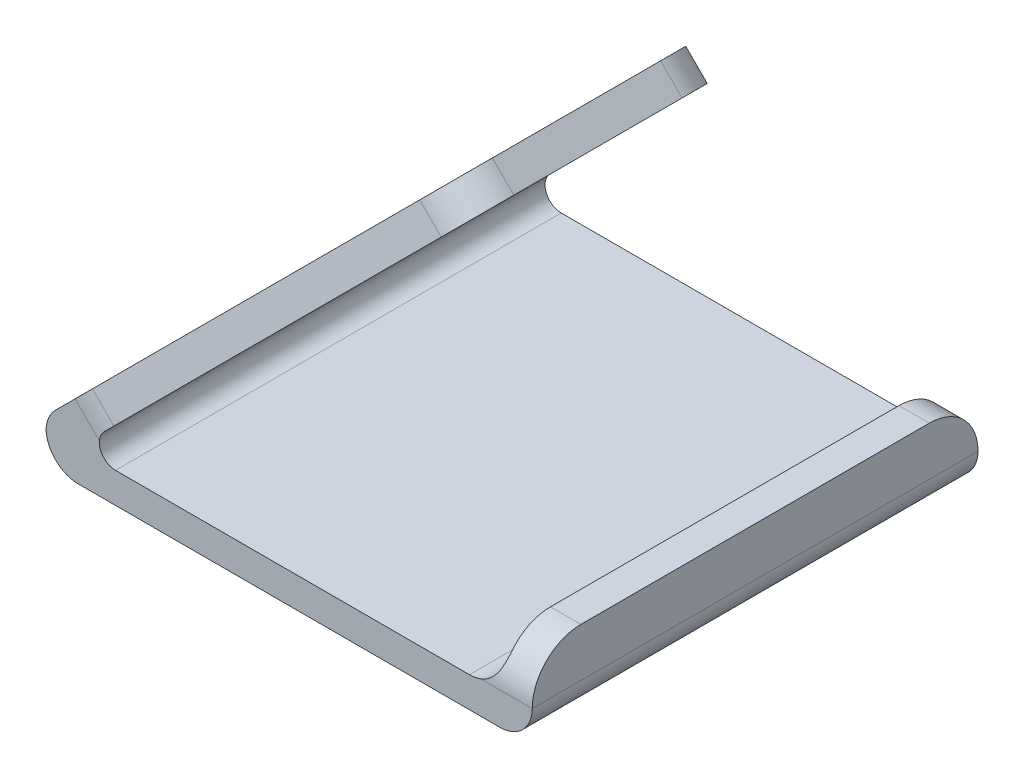
ISO-10303-21;
HEADER;
FILE_DESCRIPTION(('STEP AP214'),'2;1');
FILE_NAME('part.step','',(''),(''),'','','');
FILE_SCHEMA(('AUTOMOTIVE_DESIGN { 1 0 10303 214 1 1 1 1 }'));
ENDSEC;
DATA;
#1=APPLICATION_CONTEXT('core data for automotive mechanical design processes');
#2=APPLICATION_PROTOCOL_DEFINITION('international standard','automotive_design',2000,#1);
#3=PRODUCT_CONTEXT('',#1,'mechanical');
#4=PRODUCT('Part','Part','',(#3));
#5=PRODUCT_RELATED_PRODUCT_CATEGORY('part','',(#4));
#6=PRODUCT_DEFINITION_FORMATION('','',#4);
#7=PRODUCT_DEFINITION_CONTEXT('part definition',#1,'design');
#8=PRODUCT_DEFINITION('design','',#6,#7);
#9=PRODUCT_DEFINITION_SHAPE('','',#8);
#10=(LENGTH_UNIT() NAMED_UNIT(*) SI_UNIT(.MILLI.,.METRE.));
#11=(NAMED_UNIT(*) PLANE_ANGLE_UNIT() SI_UNIT($,.RADIAN.));
#12=(NAMED_UNIT(*) SI_UNIT($,.STERADIAN.) SOLID_ANGLE_UNIT());
#13=UNCERTAINTY_MEASURE_WITH_UNIT(LENGTH_MEASURE(1.E-05),#10,'distance_accuracy_value','');
#14=(GEOMETRIC_REPRESENTATION_CONTEXT(3) GLOBAL_UNCERTAINTY_ASSIGNED_CONTEXT((#13)) GLOBAL_UNIT_ASSIGNED_CONTEXT((#10,
#11,#12)) REPRESENTATION_CONTEXT('',''));
#15=CARTESIAN_POINT('',(0.,0.,0.));
#16=DIRECTION('',(0.,0.,1.));
#17=DIRECTION('',(1.,0.,0.));
#18=AXIS2_PLACEMENT_3D('',#15,#16,#17);
#19=CARTESIAN_POINT('',(0.,12.7,69.85));
#20=DIRECTION('',(-1.,0.,0.));
#21=DIRECTION('',(0.,-1.,0.));
#22=AXIS2_PLACEMENT_3D('',#19,#20,#21);
#23=PLANE('',#22);
#24=DIRECTION('',(0.,0.,-1.));
#25=VECTOR('',#24,1.);
#26=CARTESIAN_POINT('',(0.,5.08,69.85));
#27=LINE('',#26,#25);
#28=CARTESIAN_POINT('',(0.,5.08,69.85));
#29=VERTEX_POINT('',#28);
#30=CARTESIAN_POINT('',(0.,5.08,0.));
#31=VERTEX_POINT('',#30);
#32=EDGE_CURVE('E257',#29,#31,#27,.T.);
#33=ORIENTED_EDGE('',*,*,#32,.T.);
#34=CARTESIAN_POINT('',(0.,5.08,7.62));
#35=DIRECTION('',(-1.,0.,0.));
#36=DIRECTION('',(0.,-1.,0.));
#37=AXIS2_PLACEMENT_3D('',#34,#35,#36);
#38=CIRCLE('',#37,7.62);
#39=CARTESIAN_POINT('',(0.,12.7,7.62));
#40=VERTEX_POINT('',#39);
#41=EDGE_CURVE('E454',#31,#40,#38,.F.);
#42=ORIENTED_EDGE('',*,*,#41,.T.);
#43=DIRECTION('',(0.,0.,-1.));
#44=VECTOR('',#43,1.);
#45=CARTESIAN_POINT('',(0.,12.7,69.85));
#46=LINE('',#45,#44);
#47=CARTESIAN_POINT('',(0.,12.7,62.23));
#48=VERTEX_POINT('',#47);
#49=EDGE_CURVE('E234',#48,#40,#46,.T.);
#50=ORIENTED_EDGE('',*,*,#49,.F.);
#51=CARTESIAN_POINT('',(0.,5.08,62.23));
#52=DIRECTION('',(-1.,0.,0.));
#53=DIRECTION('',(0.,-1.,0.));
#54=AXIS2_PLACEMENT_3D('',#51,#52,#53);
#55=CIRCLE('',#54,7.62);
#56=EDGE_CURVE('E457',#48,#29,#55,.F.);
#57=ORIENTED_EDGE('',*,*,#56,.T.);
#58=EDGE_LOOP('',(#33,#42,#50,#57));
#59=FACE_BOUND('',#58,.T.);
#60=ADVANCED_FACE('F39',(#59),#23,.F.);
#61=CARTESIAN_POINT('',(-4.7625,12.7,69.85));
#62=DIRECTION('',(0.,-1.,0.));
#63=DIRECTION('',(0.,0.,-1.));
#64=AXIS2_PLACEMENT_3D('',#61,#62,#63);
#65=PLANE('',#64);
#66=ORIENTED_EDGE('',*,*,#49,.T.);
#67=DIRECTION('',(-1.,0.,0.));
#68=VECTOR('',#67,1.);
#69=CARTESIAN_POINT('',(-4.7625,12.7,7.62));
#70=LINE('',#69,#68);
#71=CARTESIAN_POINT('',(-4.7625,12.7,7.62));
#72=VERTEX_POINT('',#71);
#73=EDGE_CURVE('E295',#40,#72,#70,.T.);
#74=ORIENTED_EDGE('',*,*,#73,.T.);
#75=DIRECTION('',(0.,0.,-1.));
#76=VECTOR('',#75,1.);
#77=CARTESIAN_POINT('',(-4.7625,12.7,69.85));
#78=LINE('',#77,#76);
#79=CARTESIAN_POINT('',(-4.7625,12.7,62.23));
#80=VERTEX_POINT('',#79);
#81=EDGE_CURVE('E230',#80,#72,#78,.T.);
#82=ORIENTED_EDGE('',*,*,#81,.F.);
#83=DIRECTION('',(-1.,0.,0.));
#84=VECTOR('',#83,1.);
#85=CARTESIAN_POINT('',(-4.7625,12.7,62.23));
#86=LINE('',#85,#84);
#87=EDGE_CURVE('E292',#80,#48,#86,.F.);
#88=ORIENTED_EDGE('',*,*,#87,.T.);
#89=EDGE_LOOP('',(#66,#74,#82,#88));
#90=FACE_BOUND('',#89,.T.);
#91=ADVANCED_FACE('F373',(#90),#65,.F.);
#92=CARTESIAN_POINT('',(-4.7625,4.7625,69.85));
#93=DIRECTION('',(1.,0.,0.));
#94=DIRECTION('',(0.,1.,0.));
#95=AXIS2_PLACEMENT_3D('',#92,#93,#94);
#96=PLANE('',#95);
#97=ORIENTED_EDGE('',*,*,#81,.T.);
#98=CARTESIAN_POINT('',(-4.7625,5.08,7.62));
#99=DIRECTION('',(1.,0.,0.));
#100=DIRECTION('',(0.,1.,0.));
#101=AXIS2_PLACEMENT_3D('',#98,#99,#100);
#102=CIRCLE('',#101,7.62);
#103=CARTESIAN_POINT('',(-4.7625,9.8425,1.67163940652553));
#104=VERTEX_POINT('',#103);
#105=EDGE_CURVE('E302',#72,#104,#102,.F.);
#106=ORIENTED_EDGE('',*,*,#105,.T.);
#107=DIRECTION('',(0.,0.,-1.));
#108=VECTOR('',#107,1.);
#109=CARTESIAN_POINT('',(-4.7625,9.8425,69.85));
#110=LINE('',#109,#108);
#111=CARTESIAN_POINT('',(-4.7625,9.8425,68.1783605934745));
#112=VERTEX_POINT('',#111);
#113=EDGE_CURVE('E265',#104,#112,#110,.F.);
#114=ORIENTED_EDGE('',*,*,#113,.T.);
#115=CARTESIAN_POINT('',(-4.7625,5.08,62.23));
#116=DIRECTION('',(1.,0.,0.));
#117=DIRECTION('',(0.,1.,0.));
#118=AXIS2_PLACEMENT_3D('',#115,#116,#117);
#119=CIRCLE('',#118,7.62);
#120=EDGE_CURVE('E299',#112,#80,#119,.F.);
#121=ORIENTED_EDGE('',*,*,#120,.T.);
#122=EDGE_LOOP('',(#97,#106,#114,#121));
#123=FACE_BOUND('',#122,.T.);
#124=ADVANCED_FACE('F379',(#123),#96,.F.);
#125=CARTESIAN_POINT('',(-4.7625,4.7625,69.85));
#126=DIRECTION('',(0.,-1.,0.));
#127=DIRECTION('',(1.,0.,0.));
#128=AXIS2_PLACEMENT_3D('',#125,#126,#127);
#129=PLANE('',#128);
#130=DIRECTION('',(-1.,0.,0.));
#131=VECTOR('',#130,1.);
#132=CARTESIAN_POINT('',(-4.7625,4.7625,0.));
#133=LINE('',#132,#131);
#134=CARTESIAN_POINT('',(-9.8425,4.7625,0.));
#135=VERTEX_POINT('',#134);
#136=CARTESIAN_POINT('',(-65.3053975515724,4.76249999999999,0.));
#137=VERTEX_POINT('',#136);
#138=EDGE_CURVE('E218',#135,#137,#133,.T.);
#139=ORIENTED_EDGE('',*,*,#138,.T.);
#140=DIRECTION('',(0.,0.,-1.));
#141=VECTOR('',#140,1.);
#142=CARTESIAN_POINT('',(-65.3053975515724,4.76249999999999,69.85));
#143=LINE('',#142,#141);
#144=CARTESIAN_POINT('',(-65.3053975515724,4.76249999999999,69.85));
#145=VERTEX_POINT('',#144);
#146=EDGE_CURVE('E282',#137,#145,#143,.F.);
#147=ORIENTED_EDGE('',*,*,#146,.T.);
#148=DIRECTION('',(-1.,0.,0.));
#149=VECTOR('',#148,1.);
#150=CARTESIAN_POINT('',(-4.7625,4.7625,69.85));
#151=LINE('',#150,#149);
#152=CARTESIAN_POINT('',(-9.8425,4.7625,69.85));
#153=VERTEX_POINT('',#152);
#154=EDGE_CURVE('E210',#153,#145,#151,.T.);
#155=ORIENTED_EDGE('',*,*,#154,.F.);
#156=DIRECTION('',(0.,0.,-1.));
#157=VECTOR('',#156,1.);
#158=CARTESIAN_POINT('',(-9.8425,4.7625,0.));
#159=LINE('',#158,#157);
#160=EDGE_CURVE('E261',#153,#135,#159,.T.);
#161=ORIENTED_EDGE('',*,*,#160,.T.);
#162=EDGE_LOOP('',(#139,#147,#155,#161));
#163=FACE_BOUND('',#162,.T.);
#164=ADVANCED_FACE('F541',(#163),#129,.F.);
#165=CARTESIAN_POINT('',(-24.6307756962203,51.5692243037799,69.85));
#166=DIRECTION('',(-0.707106781186549,0.707106781186546,0.));
#167=DIRECTION('',(-0.707106781186546,-0.707106781186549,0.));
#168=AXIS2_PLACEMENT_3D('',#165,#166,#167);
#169=PLANE('',#168);
#170=DIRECTION('',(0.,0.,-1.));
#171=VECTOR('',#170,1.);
#172=CARTESIAN_POINT('',(-67.1014487757862,9.09855122421382,0.));
#173=LINE('',#172,#171);
#174=CARTESIAN_POINT('',(-67.1014487757862,9.09855122421382,69.7423558530693));
#175=VERTEX_POINT('',#174);
#176=CARTESIAN_POINT('',(-67.1014487757862,9.09855122421382,0.107644146930737));
#177=VERTEX_POINT('',#176);
#178=EDGE_CURVE('E276',#175,#177,#173,.T.);
#179=ORIENTED_EDGE('',*,*,#178,.T.);
#180=CARTESIAN_POINT('',(-68.2681908358989,7.93180916410106,12.7));
#181=DIRECTION('',(-0.707106781186549,0.707106781186546,0.));
#182=DIRECTION('',(-0.707106781186546,-0.707106781186549,0.));
#183=AXIS2_PLACEMENT_3D('',#180,#181,#182);
#184=CIRCLE('',#183,12.7);
#185=CARTESIAN_POINT('',(-65.9734420589467,10.2265579410533,0.421634632356286));
#186=VERTEX_POINT('',#185);
#187=EDGE_CURVE('E661',#177,#186,#184,.F.);
#188=ORIENTED_EDGE('',*,*,#187,.T.);
#189=DIRECTION('',(-0.683631134909205,-0.683631134909208,-0.25553266477204));
#190=VECTOR('',#189,1.);
#191=CARTESIAN_POINT('',(-24.6307756962203,51.5692243037799,15.875));
#192=LINE('',#191,#190);
#193=CARTESIAN_POINT('',(-28.6420801026904,47.5579198973098,14.3756251882702));
#194=VERTEX_POINT('',#193);
#195=EDGE_CURVE('E279',#194,#186,#192,.T.);
#196=ORIENTED_EDGE('',*,*,#195,.F.);
#197=CARTESIAN_POINT('',(-30.0189293688618,46.1810706311384,21.7426444088564));
#198=DIRECTION('',(-0.707106781186549,0.707106781186546,0.));
#199=DIRECTION('',(-0.707106781186546,-0.707106781186549,0.));
#200=AXIS2_PLACEMENT_3D('',#197,#198,#199);
#201=CIRCLE('',#200,7.62);
#202=CARTESIAN_POINT('',(-24.6307756962203,51.5692243037799,21.7426444088564));
#203=VERTEX_POINT('',#202);
#204=EDGE_CURVE('E429',#194,#203,#201,.F.);
#205=ORIENTED_EDGE('',*,*,#204,.T.);
#206=DIRECTION('',(0.,0.,-1.));
#207=VECTOR('',#206,1.);
#208=CARTESIAN_POINT('',(-24.6307756962203,51.5692243037799,69.85));
#209=LINE('',#208,#207);
#210=CARTESIAN_POINT('',(-24.6307756962203,51.5692243037799,48.1073555911436));
#211=VERTEX_POINT('',#210);
#212=EDGE_CURVE('E226',#211,#203,#209,.T.);
#213=ORIENTED_EDGE('',*,*,#212,.F.);
#214=CARTESIAN_POINT('',(-30.0189293688618,46.1810706311384,48.1073555911436));
#215=DIRECTION('',(-0.707106781186549,0.707106781186546,0.));
#216=DIRECTION('',(-0.707106781186546,-0.707106781186549,0.));
#217=AXIS2_PLACEMENT_3D('',#214,#215,#216);
#218=CIRCLE('',#217,7.62);
#219=CARTESIAN_POINT('',(-28.6420801026904,47.5579198973098,55.4743748117298));
#220=VERTEX_POINT('',#219);
#221=EDGE_CURVE('E425',#211,#220,#218,.F.);
#222=ORIENTED_EDGE('',*,*,#221,.T.);
#223=DIRECTION('',(0.683631134909205,0.683631134909208,-0.255532664772041));
#224=VECTOR('',#223,1.);
#225=CARTESIAN_POINT('',(-24.6307756962203,51.5692243037799,53.975));
#226=LINE('',#225,#224);
#227=CARTESIAN_POINT('',(-65.9734420589465,10.2265579410535,69.4283653676437));
#228=VERTEX_POINT('',#227);
#229=EDGE_CURVE('E636',#228,#220,#226,.T.);
#230=ORIENTED_EDGE('',*,*,#229,.F.);
#231=CARTESIAN_POINT('',(-68.2681908358988,7.93180916410124,57.15));
#232=DIRECTION('',(-0.707106781186549,0.707106781186546,0.));
#233=DIRECTION('',(-0.707106781186546,-0.707106781186549,0.));
#234=AXIS2_PLACEMENT_3D('',#231,#232,#233);
#235=CIRCLE('',#234,12.7);
#236=EDGE_CURVE('E354',#228,#175,#235,.F.);
#237=ORIENTED_EDGE('',*,*,#236,.T.);
#238=EDGE_LOOP('',(#179,#188,#196,#205,#213,#222,#230,#237));
#239=FACE_BOUND('',#238,.T.);
#240=ADVANCED_FACE('F535',(#239),#169,.F.);
#241=CARTESIAN_POINT('',(-27.9983717416212,54.9368203491808,69.85));
#242=DIRECTION('',(-0.707106781186545,-0.70710678118655,0.));
#243=DIRECTION('',(0.70710678118655,-0.707106781186545,0.));
#244=AXIS2_PLACEMENT_3D('',#241,#242,#243);
#245=PLANE('',#244);
#246=DIRECTION('',(0.,0.,-1.));
#247=VECTOR('',#246,1.);
#248=CARTESIAN_POINT('',(-27.9983717416212,54.9368203491808,69.85));
#249=LINE('',#248,#247);
#250=CARTESIAN_POINT('',(-27.9983717416212,54.9368203491808,48.1073555911436));
#251=VERTEX_POINT('',#250);
#252=CARTESIAN_POINT('',(-27.9983717416212,54.9368203491808,21.7426444088564));
#253=VERTEX_POINT('',#252);
#254=EDGE_CURVE('E222',#251,#253,#249,.T.);
#255=ORIENTED_EDGE('',*,*,#254,.F.);
#256=DIRECTION('',(-0.70710678118655,0.707106781186545,0.));
#257=VECTOR('',#256,1.);
#258=CARTESIAN_POINT('',(-27.9983717416212,54.9368203491808,48.1073555911436));
#259=LINE('',#258,#257);
#260=EDGE_CURVE('E432',#251,#211,#259,.F.);
#261=ORIENTED_EDGE('',*,*,#260,.T.);
#262=ORIENTED_EDGE('',*,*,#212,.T.);
#263=DIRECTION('',(-0.70710678118655,0.707106781186545,0.));
#264=VECTOR('',#263,1.);
#265=CARTESIAN_POINT('',(-27.9983717416212,54.9368203491808,21.7426444088564));
#266=LINE('',#265,#264);
#267=EDGE_CURVE('E435',#203,#253,#266,.T.);
#268=ORIENTED_EDGE('',*,*,#267,.T.);
#269=EDGE_LOOP('',(#255,#261,#262,#268));
#270=FACE_BOUND('',#269,.T.);
#271=ADVANCED_FACE('F540',(#270),#245,.F.);
#272=CARTESIAN_POINT('',(-76.2,6.73519209080186,69.85));
#273=DIRECTION('',(0.707106781186549,-0.707106781186546,0.));
#274=DIRECTION('',(0.707106781186546,0.707106781186549,0.));
#275=AXIS2_PLACEMENT_3D('',#272,#273,#274);
#276=PLANE('',#275);
#277=DIRECTION('',(0.683631134909205,0.683631134909208,0.25553266477204));
#278=VECTOR('',#277,1.);
#279=CARTESIAN_POINT('',(-27.9983717416212,54.9368203491808,15.875));
#280=LINE('',#279,#278);
#281=CARTESIAN_POINT('',(-69.3410381043477,13.5941539864542,0.421634632356286));
#282=VERTEX_POINT('',#281);
#283=CARTESIAN_POINT('',(-32.0096761480914,50.9255159427107,14.3756251882702));
#284=VERTEX_POINT('',#283);
#285=EDGE_CURVE('E641',#282,#284,#280,.T.);
#286=ORIENTED_EDGE('',*,*,#285,.F.);
#287=CARTESIAN_POINT('',(-71.6357868812999,11.299405209502,12.7));
#288=DIRECTION('',(0.707106781186549,-0.707106781186546,0.));
#289=DIRECTION('',(0.707106781186546,0.707106781186549,0.));
#290=AXIS2_PLACEMENT_3D('',#287,#288,#289);
#291=CIRCLE('',#290,12.7);
#292=CARTESIAN_POINT('',(-71.6357868812999,11.299405209502,0.));
#293=VERTEX_POINT('',#292);
#294=EDGE_CURVE('E405',#282,#293,#291,.F.);
#295=ORIENTED_EDGE('',*,*,#294,.T.);
#296=DIRECTION('',(-0.707106781186546,-0.707106781186549,0.));
#297=VECTOR('',#296,1.);
#298=CARTESIAN_POINT('',(-76.2,6.73519209080186,0.));
#299=LINE('',#298,#297);
#300=CARTESIAN_POINT('',(-74.7121024484277,8.2230896423742,0.));
#301=VERTEX_POINT('',#300);
#302=EDGE_CURVE('E211',#293,#301,#299,.T.);
#303=ORIENTED_EDGE('',*,*,#302,.T.);
#304=DIRECTION('',(0.,0.,-1.));
#305=VECTOR('',#304,1.);
#306=CARTESIAN_POINT('',(-74.7121024484277,8.2230896423742,69.85));
#307=LINE('',#306,#305);
#308=CARTESIAN_POINT('',(-74.7121024484277,8.2230896423742,69.85));
#309=VERTEX_POINT('',#308);
#310=EDGE_CURVE('E253',#301,#309,#307,.F.);
#311=ORIENTED_EDGE('',*,*,#310,.T.);
#312=DIRECTION('',(-0.707106781186546,-0.707106781186549,0.));
#313=VECTOR('',#312,1.);
#314=CARTESIAN_POINT('',(-76.2,6.73519209080186,69.85));
#315=LINE('',#314,#313);
#316=CARTESIAN_POINT('',(-71.6357868812997,11.2994052095022,69.85));
#317=VERTEX_POINT('',#316);
#318=EDGE_CURVE('E216',#317,#309,#315,.T.);
#319=ORIENTED_EDGE('',*,*,#318,.F.);
#320=CARTESIAN_POINT('',(-71.6357868812997,11.2994052095022,57.15));
#321=DIRECTION('',(0.707106781186549,-0.707106781186546,0.));
#322=DIRECTION('',(0.707106781186546,0.707106781186549,0.));
#323=AXIS2_PLACEMENT_3D('',#320,#321,#322);
#324=CIRCLE('',#323,12.7);
#325=CARTESIAN_POINT('',(-69.3410381043475,13.5941539864544,69.4283653676437));
#326=VERTEX_POINT('',#325);
#327=EDGE_CURVE('E414',#317,#326,#324,.F.);
#328=ORIENTED_EDGE('',*,*,#327,.T.);
#329=DIRECTION('',(-0.683631134909205,-0.683631134909208,0.255532664772041));
#330=VECTOR('',#329,1.);
#331=CARTESIAN_POINT('',(-27.9983717416212,54.9368203491808,53.975));
#332=LINE('',#331,#330);
#333=CARTESIAN_POINT('',(-32.0096761480914,50.9255159427107,55.4743748117298));
#334=VERTEX_POINT('',#333);
#335=EDGE_CURVE('E643',#334,#326,#332,.T.);
#336=ORIENTED_EDGE('',*,*,#335,.F.);
#337=CARTESIAN_POINT('',(-33.3865254142627,49.5486666765393,48.1073555911436));
#338=DIRECTION('',(0.707106781186549,-0.707106781186546,0.));
#339=DIRECTION('',(0.707106781186546,0.707106781186549,0.));
#340=AXIS2_PLACEMENT_3D('',#337,#338,#339);
#341=CIRCLE('',#340,7.62);
#342=EDGE_CURVE('E439',#334,#251,#341,.F.);
#343=ORIENTED_EDGE('',*,*,#342,.T.);
#344=ORIENTED_EDGE('',*,*,#254,.T.);
#345=CARTESIAN_POINT('',(-33.3865254142627,49.5486666765393,21.7426444088564));
#346=DIRECTION('',(0.707106781186549,-0.707106781186546,0.));
#347=DIRECTION('',(0.707106781186546,0.707106781186549,0.));
#348=AXIS2_PLACEMENT_3D('',#345,#346,#347);
#349=CIRCLE('',#348,7.62);
#350=EDGE_CURVE('E442',#253,#284,#349,.F.);
#351=ORIENTED_EDGE('',*,*,#350,.T.);
#352=EDGE_LOOP('',(#286,#295,#303,#311,#319,#328,#336,#343,#344,#351));
#353=FACE_BOUND('',#352,.T.);
#354=ADVANCED_FACE('F404',(#353),#276,.F.);
#355=CARTESIAN_POINT('',(0.,0.,69.85));
#356=DIRECTION('',(0.,1.,0.));
#357=DIRECTION('',(-1.,0.,0.));
#358=AXIS2_PLACEMENT_3D('',#355,#356,#357);
#359=PLANE('',#358);
#360=DIRECTION('',(1.,0.,0.));
#361=VECTOR('',#360,1.);
#362=CARTESIAN_POINT('',(0.,0.,69.85));
#363=LINE('',#362,#361);
#364=CARTESIAN_POINT('',(-71.12,0.,69.85));
#365=VERTEX_POINT('',#364);
#366=CARTESIAN_POINT('',(-5.08,0.,69.85));
#367=VERTEX_POINT('',#366);
#368=EDGE_CURVE('E201',#365,#367,#363,.T.);
#369=ORIENTED_EDGE('',*,*,#368,.F.);
#370=DIRECTION('',(0.,0.,-1.));
#371=VECTOR('',#370,1.);
#372=CARTESIAN_POINT('',(-71.12,0.,69.85));
#373=LINE('',#372,#371);
#374=CARTESIAN_POINT('',(-71.12,0.,0.));
#375=VERTEX_POINT('',#374);
#376=EDGE_CURVE('E183',#365,#375,#373,.T.);
#377=ORIENTED_EDGE('',*,*,#376,.T.);
#378=DIRECTION('',(1.,0.,0.));
#379=VECTOR('',#378,1.);
#380=CARTESIAN_POINT('',(0.,0.,0.));
#381=LINE('',#380,#379);
#382=CARTESIAN_POINT('',(-5.08,0.,0.));
#383=VERTEX_POINT('',#382);
#384=EDGE_CURVE('E198',#375,#383,#381,.T.);
#385=ORIENTED_EDGE('',*,*,#384,.T.);
#386=DIRECTION('',(0.,0.,-1.));
#387=VECTOR('',#386,1.);
#388=CARTESIAN_POINT('',(-5.08,0.,69.85));
#389=LINE('',#388,#387);
#390=EDGE_CURVE('E204',#383,#367,#389,.F.);
#391=ORIENTED_EDGE('',*,*,#390,.T.);
#392=EDGE_LOOP('',(#369,#377,#385,#391));
#393=FACE_BOUND('',#392,.T.);
#394=ADVANCED_FACE('F197',(#393),#359,.F.);
#395=CARTESIAN_POINT('',(0.,0.,69.85));
#396=DIRECTION('',(0.,0.,-1.));
#397=DIRECTION('',(-1.,0.,0.));
#398=AXIS2_PLACEMENT_3D('',#395,#396,#397);
#399=PLANE('',#398);
#400=CARTESIAN_POINT('',(-65.3053975515724,7.3025,69.85));
#401=DIRECTION('',(0.,0.,-1.));
#402=DIRECTION('',(-1.,0.,0.));
#403=AXIS2_PLACEMENT_3D('',#400,#401,#402);
#404=CIRCLE('',#403,2.54);
#405=CARTESIAN_POINT('',(-67.837611312294,7.50122964049649,69.85));
#406=VERTEX_POINT('',#405);
#407=EDGE_CURVE('E288',#145,#406,#404,.T.);
#408=ORIENTED_EDGE('',*,*,#407,.T.);
#409=DIRECTION('',(-0.707106781186549,0.707106781186546,0.));
#410=VECTOR('',#409,1.);
#411=CARTESIAN_POINT('',(-30.1681908358986,-30.1681908358987,69.85));
#412=LINE('',#411,#410);
#413=EDGE_CURVE('E49',#406,#317,#412,.T.);
#414=ORIENTED_EDGE('',*,*,#413,.T.);
#415=ORIENTED_EDGE('',*,*,#318,.T.);
#416=CARTESIAN_POINT('',(-71.12,4.63098719394654,69.85));
#417=DIRECTION('',(0.,0.,-1.));
#418=DIRECTION('',(-1.,0.,0.));
#419=AXIS2_PLACEMENT_3D('',#416,#417,#418);
#420=CIRCLE('',#419,5.08);
#421=CARTESIAN_POINT('',(-76.1950366377988,4.85549359697327,69.85));
#422=VERTEX_POINT('',#421);
#423=EDGE_CURVE('E247',#309,#422,#420,.F.);
#424=ORIENTED_EDGE('',*,*,#423,.T.);
#425=CARTESIAN_POINT('',(-71.12,5.07999999999999,69.85));
#426=DIRECTION('',(0.,0.,-1.));
#427=DIRECTION('',(-1.,0.,0.));
#428=AXIS2_PLACEMENT_3D('',#425,#426,#427);
#429=CIRCLE('',#428,5.08);
#430=EDGE_CURVE('E250',#422,#365,#429,.F.);
#431=ORIENTED_EDGE('',*,*,#430,.T.);
#432=ORIENTED_EDGE('',*,*,#368,.T.);
#433=CARTESIAN_POINT('',(-5.08,5.08,69.85));
#434=DIRECTION('',(0.,0.,-1.));
#435=DIRECTION('',(-1.,0.,0.));
#436=AXIS2_PLACEMENT_3D('',#433,#434,#435);
#437=CIRCLE('',#436,5.08);
#438=EDGE_CURVE('E191',#367,#29,#437,.F.);
#439=ORIENTED_EDGE('',*,*,#438,.T.);
#440=DIRECTION('',(-1.,0.,0.));
#441=VECTOR('',#440,1.);
#442=CARTESIAN_POINT('',(0.,5.08,69.85));
#443=LINE('',#442,#441);
#444=CARTESIAN_POINT('',(-8.07473481480147,5.08,69.85));
#445=VERTEX_POINT('',#444);
#446=EDGE_CURVE('E450',#29,#445,#443,.T.);
#447=ORIENTED_EDGE('',*,*,#446,.T.);
#448=CARTESIAN_POINT('',(-9.8425,9.8425,69.85));
#449=DIRECTION('',(0.,0.,-1.));
#450=DIRECTION('',(-1.,0.,0.));
#451=AXIS2_PLACEMENT_3D('',#448,#449,#450);
#452=CIRCLE('',#451,5.08);
#453=EDGE_CURVE('E273',#445,#153,#452,.T.);
#454=ORIENTED_EDGE('',*,*,#453,.T.);
#455=ORIENTED_EDGE('',*,*,#154,.T.);
#456=EDGE_LOOP('',(#408,#414,#415,#424,#431,#432,#439,#447,#454,#455));
#457=FACE_BOUND('',#456,.T.);
#458=ADVANCED_FACE('F391',(#457),#399,.F.);
#459=CARTESIAN_POINT('',(0.,0.,0.));
#460=DIRECTION('',(0.,0.,-1.));
#461=DIRECTION('',(-1.,0.,0.));
#462=AXIS2_PLACEMENT_3D('',#459,#460,#461);
#463=PLANE('',#462);
#464=ORIENTED_EDGE('',*,*,#302,.F.);
#465=DIRECTION('',(-0.707106781186549,0.707106781186546,0.));
#466=VECTOR('',#465,1.);
#467=CARTESIAN_POINT('',(-68.2681908358989,7.93180916410106,0.));
#468=LINE('',#467,#466);
#469=CARTESIAN_POINT('',(-67.837611312294,7.50122964049616,0.));
#470=VERTEX_POINT('',#469);
#471=EDGE_CURVE('E407',#293,#470,#468,.F.);
#472=ORIENTED_EDGE('',*,*,#471,.T.);
#473=CARTESIAN_POINT('',(-65.3053975515724,7.3025,0.));
#474=DIRECTION('',(0.,0.,-1.));
#475=DIRECTION('',(-1.,0.,0.));
#476=AXIS2_PLACEMENT_3D('',#473,#474,#475);
#477=CIRCLE('',#476,2.54);
#478=EDGE_CURVE('E285',#470,#137,#477,.F.);
#479=ORIENTED_EDGE('',*,*,#478,.T.);
#480=ORIENTED_EDGE('',*,*,#138,.F.);
#481=CARTESIAN_POINT('',(-9.8425,9.8425,0.));
#482=DIRECTION('',(0.,0.,-1.));
#483=DIRECTION('',(-1.,0.,0.));
#484=AXIS2_PLACEMENT_3D('',#481,#482,#483);
#485=CIRCLE('',#484,5.08);
#486=CARTESIAN_POINT('',(-8.07473481480147,5.08,0.));
#487=VERTEX_POINT('',#486);
#488=EDGE_CURVE('E269',#135,#487,#485,.F.);
#489=ORIENTED_EDGE('',*,*,#488,.T.);
#490=DIRECTION('',(-1.,0.,0.));
#491=VECTOR('',#490,1.);
#492=CARTESIAN_POINT('',(0.,5.08,0.));
#493=LINE('',#492,#491);
#494=EDGE_CURVE('E459',#487,#31,#493,.F.);
#495=ORIENTED_EDGE('',*,*,#494,.T.);
#496=CARTESIAN_POINT('',(-5.08,5.08,0.));
#497=DIRECTION('',(0.,0.,-1.));
#498=DIRECTION('',(-1.,0.,0.));
#499=AXIS2_PLACEMENT_3D('',#496,#497,#498);
#500=CIRCLE('',#499,5.08);
#501=EDGE_CURVE('E203',#31,#383,#500,.T.);
#502=ORIENTED_EDGE('',*,*,#501,.T.);
#503=ORIENTED_EDGE('',*,*,#384,.F.);
#504=CARTESIAN_POINT('',(-71.12,5.07999999999999,0.));
#505=DIRECTION('',(0.,0.,-1.));
#506=DIRECTION('',(-1.,0.,0.));
#507=AXIS2_PLACEMENT_3D('',#504,#505,#506);
#508=CIRCLE('',#507,5.08);
#509=CARTESIAN_POINT('',(-76.1950366377988,4.85549359697327,0.));
#510=VERTEX_POINT('',#509);
#511=EDGE_CURVE('E179',#375,#510,#508,.T.);
#512=ORIENTED_EDGE('',*,*,#511,.T.);
#513=CARTESIAN_POINT('',(-71.12,4.63098719394654,0.));
#514=DIRECTION('',(0.,0.,-1.));
#515=DIRECTION('',(-1.,0.,0.));
#516=AXIS2_PLACEMENT_3D('',#513,#514,#515);
#517=CIRCLE('',#516,5.08);
#518=EDGE_CURVE('E192',#510,#301,#517,.T.);
#519=ORIENTED_EDGE('',*,*,#518,.T.);
#520=EDGE_LOOP('',(#464,#472,#479,#480,#489,#495,#502,#503,#512,#519));
#521=FACE_BOUND('',#520,.T.);
#522=ADVANCED_FACE('F207',(#521),#463,.T.);
#523=CARTESIAN_POINT('',(-71.12,4.63098719394654,69.85));
#524=DIRECTION('',(0.,0.,-1.));
#525=DIRECTION('',(-1.,0.,0.));
#526=AXIS2_PLACEMENT_3D('',#523,#524,#525);
#527=CYLINDRICAL_SURFACE('',#526,5.08);
#528=DIRECTION('',(0.,0.,-1.));
#529=VECTOR('',#528,1.);
#530=CARTESIAN_POINT('',(-76.1950366377988,4.85549359697327,34.925));
#531=LINE('',#530,#529);
#532=EDGE_CURVE('E185',#422,#510,#531,.T.);
#533=ORIENTED_EDGE('',*,*,#532,.F.);
#534=ORIENTED_EDGE('',*,*,#423,.F.);
#535=ORIENTED_EDGE('',*,*,#310,.F.);
#536=ORIENTED_EDGE('',*,*,#518,.F.);
#537=EDGE_LOOP('',(#533,#534,#535,#536));
#538=FACE_BOUND('',#537,.T.);
#539=ADVANCED_FACE('F385',(#538),#527,.T.);
#540=CARTESIAN_POINT('',(-71.12,5.07999999999999,69.85));
#541=DIRECTION('',(0.,0.,-1.));
#542=DIRECTION('',(-1.,0.,0.));
#543=AXIS2_PLACEMENT_3D('',#540,#541,#542);
#544=CYLINDRICAL_SURFACE('',#543,5.08);
#545=ORIENTED_EDGE('',*,*,#430,.F.);
#546=ORIENTED_EDGE('',*,*,#532,.T.);
#547=ORIENTED_EDGE('',*,*,#511,.F.);
#548=ORIENTED_EDGE('',*,*,#376,.F.);
#549=EDGE_LOOP('',(#545,#546,#547,#548));
#550=FACE_BOUND('',#549,.T.);
#551=ADVANCED_FACE('F182',(#550),#544,.T.);
#552=CARTESIAN_POINT('',(-5.08,5.08,69.85));
#553=DIRECTION('',(0.,0.,-1.));
#554=DIRECTION('',(-1.,0.,0.));
#555=AXIS2_PLACEMENT_3D('',#552,#553,#554);
#556=CYLINDRICAL_SURFACE('',#555,5.08);
#557=ORIENTED_EDGE('',*,*,#438,.F.);
#558=ORIENTED_EDGE('',*,*,#390,.F.);
#559=ORIENTED_EDGE('',*,*,#501,.F.);
#560=ORIENTED_EDGE('',*,*,#32,.F.);
#561=EDGE_LOOP('',(#557,#558,#559,#560));
#562=FACE_BOUND('',#561,.T.);
#563=ADVANCED_FACE('F330',(#562),#556,.T.);
#564=CARTESIAN_POINT('',(-9.8425,9.8425,69.85));
#565=DIRECTION('',(0.,0.,1.));
#566=DIRECTION('',(1.,0.,0.));
#567=AXIS2_PLACEMENT_3D('',#564,#565,#566);
#568=CYLINDRICAL_SURFACE('',#567,5.08);
#569=ORIENTED_EDGE('',*,*,#113,.F.);
#570=CARTESIAN_POINT('',(-4.7625,9.8425,1.67163940652553));
#571=CARTESIAN_POINT('',(-4.76248934075149,9.73607523403745,1.58640254437952));
#572=CARTESIAN_POINT('',(-4.76584480010724,9.62729983064273,1.50402872084206));
#573=CARTESIAN_POINT('',(-4.78009462889294,9.40574104197163,1.34538027066019));
#574=CARTESIAN_POINT('',(-4.79099500759263,9.29295452995789,1.26911055979027));
#575=CARTESIAN_POINT('',(-4.82118796168516,9.06390496883602,1.12296763840993));
#576=CARTESIAN_POINT('',(-4.8405049594166,8.94763272649719,1.05311376425537));
#577=CARTESIAN_POINT('',(-4.88821722157851,8.71298292267485,0.920448700022118));
#578=CARTESIAN_POINT('',(-4.91660998165525,8.59460595046749,0.857635573579428));
#579=CARTESIAN_POINT('',(-4.98319339816391,8.35625295659713,0.738983767115417));
#580=CARTESIAN_POINT('',(-5.02143606553107,8.23627175430256,0.683184524482634));
#581=CARTESIAN_POINT('',(-5.10799575220775,7.99666846724369,0.579083289434685));
#582=CARTESIAN_POINT('',(-5.15631366718006,7.8770464153666,0.530781964230872));
#583=CARTESIAN_POINT('',(-5.26299272681702,7.63991782024807,0.441753850154116));
#584=CARTESIAN_POINT('',(-5.32132555811158,7.52240631759923,0.401006363354379));
#585=CARTESIAN_POINT('',(-5.44801341320852,7.29057270312571,0.326675205953075));
#586=CARTESIAN_POINT('',(-5.51636764554498,7.17625034027843,0.293090970129064));
#587=CARTESIAN_POINT('',(-5.65700222668459,6.96096967186279,0.235029363937482));
#588=CARTESIAN_POINT('',(-5.7285492348436,6.85966800494741,0.210043036171265));
#589=CARTESIAN_POINT('',(-5.87951967797226,6.66182777951721,0.165302709691961));
#590=CARTESIAN_POINT('',(-5.95894634005705,6.56529119698529,0.145550867023638));
#591=CARTESIAN_POINT('',(-6.12534653847425,6.37768749414149,0.110703617925492));
#592=CARTESIAN_POINT('',(-6.21233590049539,6.28663255251421,0.0956182924615249));
#593=CARTESIAN_POINT('',(-6.39316484615093,6.11096116522973,0.069542592054762));
#594=CARTESIAN_POINT('',(-6.48700512816091,6.02634537777381,0.0585526352885586));
#595=CARTESIAN_POINT('',(-6.69459511605332,5.85277820030949,0.0387148808250705));
#596=CARTESIAN_POINT('',(-6.80928796458464,5.76489310008229,0.0303863735993122));
#597=CARTESIAN_POINT('',(-7.04589757738264,5.59911757232657,0.0172484941918697));
#598=CARTESIAN_POINT('',(-7.16781601001729,5.52122946632299,0.0124399382064032));
#599=CARTESIAN_POINT('',(-7.41761944926333,5.37627705367548,0.00541553308672057));
#600=CARTESIAN_POINT('',(-7.54549024316222,5.30918851356186,0.00319380737554088));
#601=CARTESIAN_POINT('',(-7.8064393799743,5.18613787550539,0.000495738037333151));
#602=CARTESIAN_POINT('',(-7.93951579695856,5.13017170834364,1.87549649128543E-05));
#603=CARTESIAN_POINT('',(-8.07473481480147,5.08,0.));
#604=B_SPLINE_CURVE_WITH_KNOTS('',3,(#570,#571,#572,#573,#574,#575,#576,#577,#578,#579,#580,
#581,#582,#583,#584,#585,#586,#587,#588,#589,#590,#591,#592,#593,#594,#595,#596,#597,#598,#599,
#600,#601,#602,#603),.UNSPECIFIED.,.F.,.F.,(4,2,2,2,2,2,2,2,2,2,2,2,2,2,2,2,4),(0.,
0.409028957614821,0.818384068209518,1.22893499044329,1.63937272345782,2.05202380308361,
2.46471158194664,2.87625129752818,3.28775852819365,3.66685239669885,4.0461021692599,
4.42616559507608,4.80626781840194,5.23987410163648,5.6735808964338,6.10630049268804,
6.53886148200199),.UNSPECIFIED.);
#605=EDGE_CURVE('E314',#104,#487,#604,.T.);
#606=ORIENTED_EDGE('',*,*,#605,.T.);
#607=ORIENTED_EDGE('',*,*,#488,.F.);
#608=ORIENTED_EDGE('',*,*,#160,.F.);
#609=ORIENTED_EDGE('',*,*,#453,.F.);
#610=CARTESIAN_POINT('',(-8.07473481480147,5.08,69.85));
#611=CARTESIAN_POINT('',(-7.94614390625118,5.12771530610201,69.8499844358119));
#612=CARTESIAN_POINT('',(-7.81949078444172,5.18066715563883,69.8495515986044));
#613=CARTESIAN_POINT('',(-7.57086594783939,5.29663828014951,69.8471448061564));
#614=CARTESIAN_POINT('',(-7.44889518228041,5.35965958323233,69.8451705401417));
#615=CARTESIAN_POINT('',(-7.21007592273773,5.4955819918658,69.8389629022321));
#616=CARTESIAN_POINT('',(-7.09324686595845,5.56851692858057,69.834721641974));
#617=CARTESIAN_POINT('',(-6.8660010953002,5.72354773319831,69.8231739230784));
#618=CARTESIAN_POINT('',(-6.75558388611612,5.80564289205343,69.8158677015638));
#619=CARTESIAN_POINT('',(-6.54169768078262,5.97855630502436,69.797335820881));
#620=CARTESIAN_POINT('',(-6.43824633905282,6.06939540296657,69.7861006192724));
#621=CARTESIAN_POINT('',(-6.23937664497313,6.25882083261534,69.7588733071904));
#622=CARTESIAN_POINT('',(-6.14395772997352,6.35740662075038,69.7428815302586));
#623=CARTESIAN_POINT('',(-5.96211863939382,6.56109378584312,69.7053897378801));
#624=CARTESIAN_POINT('',(-5.87567445738029,6.6661765147794,69.6839049788138));
#625=CARTESIAN_POINT('',(-5.71211425012445,6.88198641020707,69.6346936090835));
#626=CARTESIAN_POINT('',(-5.6349975245383,6.99271315203423,69.6069674674961));
#627=CARTESIAN_POINT('',(-5.49438584810145,7.21259033611323,69.5463356995868));
#628=CARTESIAN_POINT('',(-5.43038668879049,7.32151537791045,69.5137807985258));
#629=CARTESIAN_POINT('',(-5.31144428862726,7.54214374700515,69.4421907397078));
#630=CARTESIAN_POINT('',(-5.25650083508727,7.65384700898075,69.4031557341897));
#631=CARTESIAN_POINT('',(-5.15563567987004,7.87909291458874,69.3182998945398));
#632=CARTESIAN_POINT('',(-5.1097357258076,7.99263929823256,69.2724631563979));
#633=CARTESIAN_POINT('',(-5.02701476995686,8.22010906819174,69.1740245089986));
#634=CARTESIAN_POINT('',(-4.99019452451052,8.33403248511356,69.1214220367088));
#635=CARTESIAN_POINT('',(-4.92315266888164,8.56879834151557,69.0057614771065));
#636=CARTESIAN_POINT('',(-4.89354718197867,8.68958658615829,68.9422364537086));
#637=CARTESIAN_POINT('',(-4.84380243475596,8.92905142565895,68.8078470305754));
#638=CARTESIAN_POINT('',(-4.82366660577684,9.04772724011186,68.7369799817822));
#639=CARTESIAN_POINT('',(-4.79218853989977,9.28157294665469,68.5884828800147));
#640=CARTESIAN_POINT('',(-4.78082694610859,9.39675001453748,68.5108681367986));
#641=CARTESIAN_POINT('',(-4.76598031953907,9.6229319869704,68.349278421547));
#642=CARTESIAN_POINT('',(-4.76248819921462,9.73394055713277,68.2653092430754));
#643=CARTESIAN_POINT('',(-4.7625,9.8425,68.1783605934745));
#644=B_SPLINE_CURVE_WITH_KNOTS('',3,(#610,#611,#612,#613,#614,#615,#616,#617,#618,#619,#620,
#621,#622,#623,#624,#625,#626,#627,#628,#629,#630,#631,#632,#633,#634,#635,#636,#637,#638,#639,
#640,#641,#642,#643),.UNSPECIFIED.,.F.,.F.,(4,2,2,2,2,2,2,2,2,2,2,2,2,2,2,2,4),(0.,
0.41136983530081,0.822822630117994,1.23571655012877,1.64857853218962,2.06245029050548,
2.47629303406184,2.88899861326559,3.3016731855725,3.69256096237348,4.08343955724124,
4.47524695358742,4.86708697656846,5.28547613967382,5.70401678995124,6.12163143640898,
6.53886981270819),.UNSPECIFIED.);
#645=EDGE_CURVE('E305',#445,#112,#644,.T.);
#646=ORIENTED_EDGE('',*,*,#645,.T.);
#647=EDGE_LOOP('',(#569,#606,#607,#608,#609,#646));
#648=FACE_BOUND('',#647,.T.);
#649=ADVANCED_FACE('F324',(#648),#568,.F.);
#650=CARTESIAN_POINT('',(-65.3053975515724,7.3025,69.85));
#651=DIRECTION('',(0.,0.,1.));
#652=DIRECTION('',(1.,0.,0.));
#653=AXIS2_PLACEMENT_3D('',#650,#651,#652);
#654=CYLINDRICAL_SURFACE('',#653,2.54);
#655=ORIENTED_EDGE('',*,*,#478,.F.);
#656=CARTESIAN_POINT('',(-67.837611312294,7.50122964049616,0.));
#657=CARTESIAN_POINT('',(-67.8321064055312,7.57146570919669,-2.20040034877681E-06));
#658=CARTESIAN_POINT('',(-67.8236651005447,7.64146973427924,0.000338683503794113));
#659=CARTESIAN_POINT('',(-67.8010020688739,7.78052898205391,0.00183650016563423));
#660=CARTESIAN_POINT('',(-67.786780170272,7.84958417646422,0.00299345719447782));
#661=CARTESIAN_POINT('',(-67.7526232271255,7.98635867100117,0.00625574543443655));
#662=CARTESIAN_POINT('',(-67.7326796984079,8.05407582647689,0.00836248768101052));
#663=CARTESIAN_POINT('',(-67.6872545368686,8.18756121547334,0.0136296026713109));
#664=CARTESIAN_POINT('',(-67.6617732484217,8.25332956989466,0.0167899099038524));
#665=CARTESIAN_POINT('',(-67.5772445240417,8.44711492279214,0.0279963710599467));
#666=CARTESIAN_POINT('',(-67.5101118727419,8.57161363012782,0.0377680938295342));
#667=CARTESIAN_POINT('',(-67.3566181784695,8.80708749217495,0.0622569303831482));
#668=CARTESIAN_POINT('',(-67.2703127318705,8.91810034120656,0.0769598066357067));
#669=CARTESIAN_POINT('',(-67.1515603361559,9.04737327185095,0.0984129091999811));
#670=CARTESIAN_POINT('',(-67.1267618606214,9.0732442241075,0.102951416806093));
#671=CARTESIAN_POINT('',(-67.1014487757862,9.09855122421382,0.107644146930738));
#672=B_SPLINE_CURVE_WITH_KNOTS('',3,(#656,#657,#658,#659,#660,#661,#662,#663,#664,#665,#666,
#667,#668,#669,#670,#671),.UNSPECIFIED.,.F.,.F.,(4,2,2,2,2,2,2,4),(0.,0.211288992805684,
0.422584269903982,0.634194494693267,0.845791563908958,1.26898136811759,1.69095968311021,
1.79929185310151),.UNSPECIFIED.);
#673=EDGE_CURVE('E62',#470,#177,#672,.T.);
#674=ORIENTED_EDGE('',*,*,#673,.T.);
#675=ORIENTED_EDGE('',*,*,#178,.F.);
#676=CARTESIAN_POINT('',(-67.1014487757862,9.09855122421382,69.7423558530693));
#677=CARTESIAN_POINT('',(-67.150849648974,9.04916099417651,69.7515149064505));
#678=CARTESIAN_POINT('',(-67.1982566571273,8.99766790323299,69.7600817317904));
#679=CARTESIAN_POINT('',(-67.2887476557053,8.89083665167487,69.7760072701649));
#680=CARTESIAN_POINT('',(-67.3318314848431,8.83549834773536,69.7833659381327));
#681=CARTESIAN_POINT('',(-67.413396982552,8.7212571923121,69.7968607257605));
#682=CARTESIAN_POINT('',(-67.4518717959637,8.66234922276609,69.8029950331933));
#683=CARTESIAN_POINT('',(-67.5238385637134,8.54148028348201,69.8140435058637));
#684=CARTESIAN_POINT('',(-67.5573308461777,8.47951951514517,69.8189577514632));
#685=CARTESIAN_POINT('',(-67.6499803529763,8.28958966293992,69.8319347807425));
#686=CARTESIAN_POINT('',(-67.7013106829239,8.15757240647762,69.8382319290393));
#687=CARTESIAN_POINT('',(-67.7812137070626,7.88709906853608,69.8467537521515));
#688=CARTESIAN_POINT('',(-67.809851168528,7.74866251406741,69.848990040755));
#689=CARTESIAN_POINT('',(-67.8311999233605,7.57312849587733,69.8499117170998));
#690=CARTESIAN_POINT('',(-67.834792380493,7.53720226553751,69.850000975438));
#691=CARTESIAN_POINT('',(-67.837611312294,7.50122964049649,69.85));
#692=B_SPLINE_CURVE_WITH_KNOTS('',3,(#676,#677,#678,#679,#680,#681,#682,#683,#684,#685,#686,
#687,#688,#689,#690,#691),.UNSPECIFIED.,.F.,.F.,(4,2,2,2,2,2,2,4),(0.,0.211297609700886,
0.42260309945145,0.634219069006463,0.845821096340751,1.26902286591341,1.69101238888882,
1.79929230307341),.UNSPECIFIED.);
#693=EDGE_CURVE('E341',#175,#406,#692,.T.);
#694=ORIENTED_EDGE('',*,*,#693,.T.);
#695=ORIENTED_EDGE('',*,*,#407,.F.);
#696=ORIENTED_EDGE('',*,*,#146,.F.);
#697=EDGE_LOOP('',(#655,#674,#675,#694,#695,#696));
#698=FACE_BOUND('',#697,.T.);
#699=ADVANCED_FACE('F329',(#698),#654,.F.);
#700=CARTESIAN_POINT('',(13.4702243037799,13.4682243037799,15.875));
#701=DIRECTION('',(-0.180688880074978,-0.180688880074979,0.966800422649111));
#702=DIRECTION('',(0.,-0.982979974693965,-0.183712735951137));
#703=AXIS2_PLACEMENT_3D('',#700,#701,#702);
#704=PLANE('',#703);
#705=ORIENTED_EDGE('',*,*,#195,.T.);
#706=DIRECTION('',(-0.707106781186549,0.707106781186546,0.));
#707=VECTOR('',#706,1.);
#708=CARTESIAN_POINT('',(-69.3410381043476,13.5941539864542,0.421634632356291));
#709=LINE('',#708,#707);
#710=EDGE_CURVE('E419',#186,#282,#709,.T.);
#711=ORIENTED_EDGE('',*,*,#710,.T.);
#712=ORIENTED_EDGE('',*,*,#285,.T.);
#713=DIRECTION('',(-0.70710678118655,0.707106781186545,0.));
#714=VECTOR('',#713,1.);
#715=CARTESIAN_POINT('',(9.4589198973098,9.45691989730981,14.3756251882702));
#716=LINE('',#715,#714);
#717=EDGE_CURVE('E422',#284,#194,#716,.F.);
#718=ORIENTED_EDGE('',*,*,#717,.T.);
#719=EDGE_LOOP('',(#705,#711,#712,#718));
#720=FACE_BOUND('',#719,.T.);
#721=ADVANCED_FACE('F336',(#720),#704,.F.);
#722=CARTESIAN_POINT('',(13.4702243037799,13.4682243037799,53.975));
#723=DIRECTION('',(-0.180688880074979,-0.180688880074979,-0.966800422649111));
#724=DIRECTION('',(0.,0.982979974693965,-0.183712735951137));
#725=AXIS2_PLACEMENT_3D('',#722,#723,#724);
#726=PLANE('',#725);
#727=ORIENTED_EDGE('',*,*,#335,.T.);
#728=DIRECTION('',(-0.707106781186549,0.707106781186546,0.));
#729=VECTOR('',#728,1.);
#730=CARTESIAN_POINT('',(-27.8724420589464,-27.8744420589465,69.4283653676437));
#731=LINE('',#730,#729);
#732=EDGE_CURVE('E11',#326,#228,#731,.F.);
#733=ORIENTED_EDGE('',*,*,#732,.T.);
#734=ORIENTED_EDGE('',*,*,#229,.T.);
#735=DIRECTION('',(-0.70710678118655,0.707106781186545,0.));
#736=VECTOR('',#735,1.);
#737=CARTESIAN_POINT('',(9.4589198973098,9.4569198973098,55.4743748117298));
#738=LINE('',#737,#736);
#739=EDGE_CURVE('E446',#220,#334,#738,.T.);
#740=ORIENTED_EDGE('',*,*,#739,.T.);
#741=EDGE_LOOP('',(#727,#733,#734,#740));
#742=FACE_BOUND('',#741,.T.);
#743=ADVANCED_FACE('F502',(#742),#726,.F.);
#744=CARTESIAN_POINT('',(-4.7625,5.08,7.62));
#745=DIRECTION('',(1.,0.,0.));
#746=DIRECTION('',(0.,0.,-1.));
#747=AXIS2_PLACEMENT_3D('',#744,#745,#746);
#748=CYLINDRICAL_SURFACE('',#747,7.62);
#749=ORIENTED_EDGE('',*,*,#41,.F.);
#750=ORIENTED_EDGE('',*,*,#494,.F.);
#751=ORIENTED_EDGE('',*,*,#605,.F.);
#752=ORIENTED_EDGE('',*,*,#105,.F.);
#753=ORIENTED_EDGE('',*,*,#73,.F.);
#754=EDGE_LOOP('',(#749,#750,#751,#752,#753));
#755=FACE_BOUND('',#754,.T.);
#756=ADVANCED_FACE('F337',(#755),#748,.T.);
#757=CARTESIAN_POINT('',(0.,5.08,62.23));
#758=DIRECTION('',(-1.,0.,0.));
#759=DIRECTION('',(0.,0.,1.));
#760=AXIS2_PLACEMENT_3D('',#757,#758,#759);
#761=CYLINDRICAL_SURFACE('',#760,7.62);
#762=ORIENTED_EDGE('',*,*,#56,.F.);
#763=ORIENTED_EDGE('',*,*,#87,.F.);
#764=ORIENTED_EDGE('',*,*,#120,.F.);
#765=ORIENTED_EDGE('',*,*,#645,.F.);
#766=ORIENTED_EDGE('',*,*,#446,.F.);
#767=EDGE_LOOP('',(#762,#763,#764,#765,#766));
#768=FACE_BOUND('',#767,.T.);
#769=ADVANCED_FACE('F321',(#768),#761,.T.);
#770=CARTESIAN_POINT('',(8.08207063113846,8.08007063113846,48.1073555911436));
#771=DIRECTION('',(-0.70710678118655,0.707106781186545,0.));
#772=DIRECTION('',(-0.707106781186545,-0.70710678118655,0.));
#773=AXIS2_PLACEMENT_3D('',#770,#771,#772);
#774=CYLINDRICAL_SURFACE('',#773,7.62);
#775=ORIENTED_EDGE('',*,*,#221,.F.);
#776=ORIENTED_EDGE('',*,*,#260,.F.);
#777=ORIENTED_EDGE('',*,*,#342,.F.);
#778=ORIENTED_EDGE('',*,*,#739,.F.);
#779=EDGE_LOOP('',(#775,#776,#777,#778));
#780=FACE_BOUND('',#779,.T.);
#781=ADVANCED_FACE('F363',(#780),#774,.T.);
#782=CARTESIAN_POINT('',(-33.3865254142627,49.5486666765393,21.7426444088564));
#783=DIRECTION('',(-0.70710678118655,0.707106781186545,0.));
#784=DIRECTION('',(-0.707106781186545,-0.70710678118655,0.));
#785=AXIS2_PLACEMENT_3D('',#782,#783,#784);
#786=CYLINDRICAL_SURFACE('',#785,7.62);
#787=ORIENTED_EDGE('',*,*,#204,.F.);
#788=ORIENTED_EDGE('',*,*,#717,.F.);
#789=ORIENTED_EDGE('',*,*,#350,.F.);
#790=ORIENTED_EDGE('',*,*,#267,.F.);
#791=EDGE_LOOP('',(#787,#788,#789,#790));
#792=FACE_BOUND('',#791,.T.);
#793=ADVANCED_FACE('F360',(#792),#786,.T.);
#794=CARTESIAN_POINT('',(-30.1671908358988,-30.1691908358989,12.7));
#795=DIRECTION('',(0.707106781186549,-0.707106781186546,0.));
#796=DIRECTION('',(0.707106781186546,0.707106781186549,0.));
#797=AXIS2_PLACEMENT_3D('',#794,#795,#796);
#798=CYLINDRICAL_SURFACE('',#797,12.7);
#799=ORIENTED_EDGE('',*,*,#673,.F.);
#800=ORIENTED_EDGE('',*,*,#471,.F.);
#801=ORIENTED_EDGE('',*,*,#294,.F.);
#802=ORIENTED_EDGE('',*,*,#710,.F.);
#803=ORIENTED_EDGE('',*,*,#187,.F.);
#804=EDGE_LOOP('',(#799,#800,#801,#802,#803));
#805=FACE_BOUND('',#804,.T.);
#806=ADVANCED_FACE('F356',(#805),#798,.T.);
#807=CARTESIAN_POINT('',(-30.1681908358986,-30.1681908358987,57.15));
#808=DIRECTION('',(-0.707106781186549,0.707106781186546,0.));
#809=DIRECTION('',(-0.707106781186546,-0.707106781186549,0.));
#810=AXIS2_PLACEMENT_3D('',#807,#808,#809);
#811=CYLINDRICAL_SURFACE('',#810,12.7);
#812=ORIENTED_EDGE('',*,*,#236,.F.);
#813=ORIENTED_EDGE('',*,*,#732,.F.);
#814=ORIENTED_EDGE('',*,*,#327,.F.);
#815=ORIENTED_EDGE('',*,*,#413,.F.);
#816=ORIENTED_EDGE('',*,*,#693,.F.);
#817=EDGE_LOOP('',(#812,#813,#814,#815,#816));
#818=FACE_BOUND('',#817,.T.);
#819=ADVANCED_FACE('F41',(#818),#811,.T.);
#820=CLOSED_SHELL('',(#60,#91,#124,#164,#240,#271,#354,#394,#458,#522,#539,#551,#563,#649,#699,
#721,#743,#756,#769,#781,#793,#806,#819));
#821=MANIFOLD_SOLID_BREP('B2',#820);
#822=ADVANCED_BREP_SHAPE_REPRESENTATION('',(#18,#821),#14);
#823=SHAPE_DEFINITION_REPRESENTATION(#9,#822);
ENDSEC;
END-ISO-10303-21;
